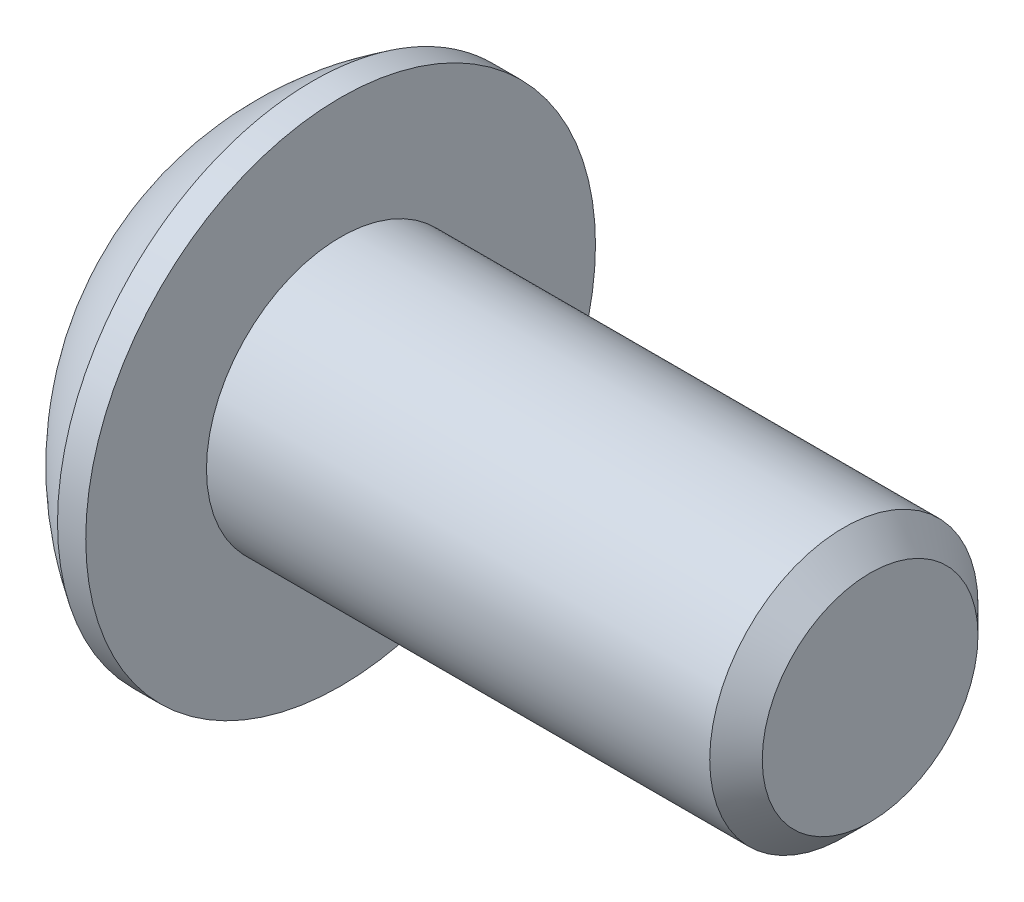
ISO-10303-21;
HEADER;
FILE_DESCRIPTION(('STEP AP214'),'2;1');
FILE_NAME('part.step','',(''),(''),'','','');
FILE_SCHEMA(('AUTOMOTIVE_DESIGN { 1 0 10303 214 1 1 1 1 }'));
ENDSEC;
DATA;
#1=APPLICATION_CONTEXT('core data for automotive mechanical design processes');
#2=APPLICATION_PROTOCOL_DEFINITION('international standard','automotive_design',2000,#1);
#3=PRODUCT_CONTEXT('',#1,'mechanical');
#4=PRODUCT('Part','Part','',(#3));
#5=PRODUCT_RELATED_PRODUCT_CATEGORY('part','',(#4));
#6=PRODUCT_DEFINITION_FORMATION('','',#4);
#7=PRODUCT_DEFINITION_CONTEXT('part definition',#1,'design');
#8=PRODUCT_DEFINITION('design','',#6,#7);
#9=PRODUCT_DEFINITION_SHAPE('','',#8);
#10=(LENGTH_UNIT() NAMED_UNIT(*) SI_UNIT(.MILLI.,.METRE.));
#11=(NAMED_UNIT(*) PLANE_ANGLE_UNIT() SI_UNIT($,.RADIAN.));
#12=(NAMED_UNIT(*) SI_UNIT($,.STERADIAN.) SOLID_ANGLE_UNIT());
#13=UNCERTAINTY_MEASURE_WITH_UNIT(LENGTH_MEASURE(1.E-05),#10,'distance_accuracy_value','');
#14=(GEOMETRIC_REPRESENTATION_CONTEXT(3) GLOBAL_UNCERTAINTY_ASSIGNED_CONTEXT((#13)) GLOBAL_UNIT_ASSIGNED_CONTEXT((#10,
#11,#12)) REPRESENTATION_CONTEXT('',''));
#15=CARTESIAN_POINT('',(0.,0.,0.));
#16=DIRECTION('',(0.,0.,1.));
#17=DIRECTION('',(1.,0.,0.));
#18=AXIS2_PLACEMENT_3D('',#15,#16,#17);
#19=CARTESIAN_POINT('',(1.77800000000006,0.,0.));
#20=DIRECTION('',(-1.,0.,0.));
#21=DIRECTION('',(0.,0.,1.));
#22=AXIS2_PLACEMENT_3D('',#19,#20,#21);
#23=CONICAL_SURFACE('',#22,1.58750000000007,1.04719755119647);
#24=CARTESIAN_POINT('',(2.69454355233878,0.,0.));
#25=VERTEX_POINT('',#24);
#26=VERTEX_LOOP('',#25);
#27=FACE_BOUND('',#26,.T.);
#28=CARTESIAN_POINT('',(1.77800000000006,0.,0.));
#29=DIRECTION('',(-1.,0.,0.));
#30=DIRECTION('',(0.,0.,1.));
#31=AXIS2_PLACEMENT_3D('',#28,#29,#30);
#32=CIRCLE('',#31,1.58750000000007);
#33=CARTESIAN_POINT('',(1.77800000000003,0.,1.58750000000004));
#34=VERTEX_POINT('',#33);
#35=CARTESIAN_POINT('',(1.77800000000003,-1.37481532850783,0.793750000000017));
#36=VERTEX_POINT('',#35);
#37=EDGE_CURVE('E20',#34,#36,#32,.F.);
#38=ORIENTED_EDGE('',*,*,#37,.F.);
#39=CARTESIAN_POINT('',(1.77800000000006,0.,0.));
#40=DIRECTION('',(-1.,0.,0.));
#41=DIRECTION('',(0.,0.,1.));
#42=AXIS2_PLACEMENT_3D('',#39,#40,#41);
#43=CIRCLE('',#42,1.58750000000007);
#44=CARTESIAN_POINT('',(1.77800000000003,1.37481532850783,0.793750000000019));
#45=VERTEX_POINT('',#44);
#46=EDGE_CURVE('E90',#34,#45,#43,.T.);
#47=ORIENTED_EDGE('',*,*,#46,.T.);
#48=CARTESIAN_POINT('',(1.77800000000006,0.,0.));
#49=DIRECTION('',(-1.,0.,0.));
#50=DIRECTION('',(0.,0.,1.));
#51=AXIS2_PLACEMENT_3D('',#48,#49,#50);
#52=CIRCLE('',#51,1.58750000000007);
#53=CARTESIAN_POINT('',(1.77800000000003,1.37481532850783,-0.793750000000019));
#54=VERTEX_POINT('',#53);
#55=EDGE_CURVE('E106',#45,#54,#52,.T.);
#56=ORIENTED_EDGE('',*,*,#55,.T.);
#57=CARTESIAN_POINT('',(1.77800000000006,0.,0.));
#58=DIRECTION('',(-1.,0.,0.));
#59=DIRECTION('',(0.,0.,1.));
#60=AXIS2_PLACEMENT_3D('',#57,#58,#59);
#61=CIRCLE('',#60,1.58750000000007);
#62=CARTESIAN_POINT('',(1.77800000000003,-2.78602967841758E-12,-1.58750000000004));
#63=VERTEX_POINT('',#62);
#64=EDGE_CURVE('E444',#54,#63,#61,.T.);
#65=ORIENTED_EDGE('',*,*,#64,.T.);
#66=CARTESIAN_POINT('',(1.77800000000006,0.,0.));
#67=DIRECTION('',(-1.,0.,0.));
#68=DIRECTION('',(0.,0.,1.));
#69=AXIS2_PLACEMENT_3D('',#66,#67,#68);
#70=CIRCLE('',#69,1.58750000000007);
#71=CARTESIAN_POINT('',(1.77800000000003,-1.37481532850783,-0.793750000000017));
#72=VERTEX_POINT('',#71);
#73=EDGE_CURVE('E446',#72,#63,#70,.F.);
#74=ORIENTED_EDGE('',*,*,#73,.F.);
#75=CARTESIAN_POINT('',(1.77800000000006,0.,0.));
#76=DIRECTION('',(-1.,0.,0.));
#77=DIRECTION('',(0.,0.,1.));
#78=AXIS2_PLACEMENT_3D('',#75,#76,#77);
#79=CIRCLE('',#78,1.58750000000007);
#80=EDGE_CURVE('E93',#36,#72,#79,.F.);
#81=ORIENTED_EDGE('',*,*,#80,.F.);
#82=EDGE_LOOP('',(#38,#47,#56,#65,#74,#81));
#83=FACE_BOUND('',#82,.T.);
#84=ADVANCED_FACE('F17',(#27,#83),#23,.F.);
#85=CARTESIAN_POINT('',(1.778,-2.74963065701559,-1.5875));
#86=DIRECTION('',(1.,0.,0.));
#87=DIRECTION('',(0.,0.,-1.));
#88=AXIS2_PLACEMENT_3D('',#85,#86,#87);
#89=PLANE('',#88);
#90=DIRECTION('',(0.,0.5,0.866025403784439));
#91=VECTOR('',#90,1.);
#92=CARTESIAN_POINT('',(1.778,-1.83308710467706,0.));
#93=LINE('',#92,#91);
#94=CARTESIAN_POINT('',(1.778,-0.91654355233853,1.5875));
#95=VERTEX_POINT('',#94);
#96=EDGE_CURVE('E111',#95,#36,#93,.F.);
#97=ORIENTED_EDGE('',*,*,#96,.F.);
#98=DIRECTION('',(0.,1.,0.));
#99=VECTOR('',#98,1.);
#100=CARTESIAN_POINT('',(1.778,-0.91654355233853,1.5875));
#101=LINE('',#100,#99);
#102=EDGE_CURVE('E109',#34,#95,#101,.F.);
#103=ORIENTED_EDGE('',*,*,#102,.F.);
#104=ORIENTED_EDGE('',*,*,#37,.T.);
#105=EDGE_LOOP('',(#97,#103,#104));
#106=FACE_BOUND('',#105,.T.);
#107=ADVANCED_FACE('F110',(#106),#89,.F.);
#108=CARTESIAN_POINT('',(1.778,-2.74963065701559,-1.5875));
#109=DIRECTION('',(1.,0.,0.));
#110=DIRECTION('',(0.,0.,-1.));
#111=AXIS2_PLACEMENT_3D('',#108,#109,#110);
#112=PLANE('',#111);
#113=DIRECTION('',(0.,-0.5,0.866025403784439));
#114=VECTOR('',#113,1.);
#115=CARTESIAN_POINT('',(1.778,-0.91654355233853,-1.5875));
#116=LINE('',#115,#114);
#117=CARTESIAN_POINT('',(1.778,-1.83308710467706,0.));
#118=VERTEX_POINT('',#117);
#119=EDGE_CURVE('E159',#118,#72,#116,.F.);
#120=ORIENTED_EDGE('',*,*,#119,.F.);
#121=DIRECTION('',(0.,0.5,0.866025403784439));
#122=VECTOR('',#121,1.);
#123=CARTESIAN_POINT('',(1.778,-1.83308710467706,0.));
#124=LINE('',#123,#122);
#125=EDGE_CURVE('E171',#36,#118,#124,.F.);
#126=ORIENTED_EDGE('',*,*,#125,.F.);
#127=ORIENTED_EDGE('',*,*,#80,.T.);
#128=EDGE_LOOP('',(#120,#126,#127));
#129=FACE_BOUND('',#128,.T.);
#130=ADVANCED_FACE('F248',(#129),#112,.F.);
#131=CARTESIAN_POINT('',(1.778,-2.74963065701559,-1.5875));
#132=DIRECTION('',(1.,0.,0.));
#133=DIRECTION('',(0.,0.,-1.));
#134=AXIS2_PLACEMENT_3D('',#131,#132,#133);
#135=PLANE('',#134);
#136=DIRECTION('',(0.,1.,0.));
#137=VECTOR('',#136,1.);
#138=CARTESIAN_POINT('',(1.778,0.916543552338532,-1.5875));
#139=LINE('',#138,#137);
#140=CARTESIAN_POINT('',(1.778,-0.91654355233853,-1.5875));
#141=VERTEX_POINT('',#140);
#142=EDGE_CURVE('E143',#141,#63,#139,.T.);
#143=ORIENTED_EDGE('',*,*,#142,.F.);
#144=DIRECTION('',(0.,-0.5,0.866025403784439));
#145=VECTOR('',#144,1.);
#146=CARTESIAN_POINT('',(1.778,-0.91654355233853,-1.5875));
#147=LINE('',#146,#145);
#148=EDGE_CURVE('E156',#72,#141,#147,.F.);
#149=ORIENTED_EDGE('',*,*,#148,.F.);
#150=ORIENTED_EDGE('',*,*,#73,.T.);
#151=EDGE_LOOP('',(#143,#149,#150));
#152=FACE_BOUND('',#151,.T.);
#153=ADVANCED_FACE('F244',(#152),#135,.F.);
#154=CARTESIAN_POINT('',(1.778,-2.74963065701559,-1.5875));
#155=DIRECTION('',(1.,0.,0.));
#156=DIRECTION('',(0.,0.,-1.));
#157=AXIS2_PLACEMENT_3D('',#154,#155,#156);
#158=PLANE('',#157);
#159=DIRECTION('',(0.,-0.5,-0.866025403784439));
#160=VECTOR('',#159,1.);
#161=CARTESIAN_POINT('',(1.778,1.83308710467706,0.));
#162=LINE('',#161,#160);
#163=CARTESIAN_POINT('',(1.778,0.916543552338532,-1.5875));
#164=VERTEX_POINT('',#163);
#165=EDGE_CURVE('E128',#164,#54,#162,.F.);
#166=ORIENTED_EDGE('',*,*,#165,.F.);
#167=DIRECTION('',(0.,1.,0.));
#168=VECTOR('',#167,1.);
#169=CARTESIAN_POINT('',(1.778,0.916543552338532,-1.5875));
#170=LINE('',#169,#168);
#171=EDGE_CURVE('E140',#63,#164,#170,.T.);
#172=ORIENTED_EDGE('',*,*,#171,.F.);
#173=ORIENTED_EDGE('',*,*,#64,.F.);
#174=EDGE_LOOP('',(#166,#172,#173));
#175=FACE_BOUND('',#174,.T.);
#176=ADVANCED_FACE('F240',(#175),#158,.F.);
#177=CARTESIAN_POINT('',(1.778,-2.74963065701559,-1.5875));
#178=DIRECTION('',(1.,0.,0.));
#179=DIRECTION('',(0.,0.,-1.));
#180=AXIS2_PLACEMENT_3D('',#177,#178,#179);
#181=PLANE('',#180);
#182=DIRECTION('',(0.,0.5,-0.866025403784439));
#183=VECTOR('',#182,1.);
#184=CARTESIAN_POINT('',(1.778,0.916543552338533,1.5875));
#185=LINE('',#184,#183);
#186=CARTESIAN_POINT('',(1.778,1.83308710467706,0.));
#187=VERTEX_POINT('',#186);
#188=EDGE_CURVE('E148',#187,#45,#185,.F.);
#189=ORIENTED_EDGE('',*,*,#188,.F.);
#190=DIRECTION('',(0.,-0.5,-0.866025403784439));
#191=VECTOR('',#190,1.);
#192=CARTESIAN_POINT('',(1.778,1.83308710467706,0.));
#193=LINE('',#192,#191);
#194=EDGE_CURVE('E125',#54,#187,#193,.F.);
#195=ORIENTED_EDGE('',*,*,#194,.F.);
#196=ORIENTED_EDGE('',*,*,#55,.F.);
#197=EDGE_LOOP('',(#189,#195,#196));
#198=FACE_BOUND('',#197,.T.);
#199=ADVANCED_FACE('F237',(#198),#181,.F.);
#200=CARTESIAN_POINT('',(1.778,-2.74963065701559,-1.5875));
#201=DIRECTION('',(1.,0.,0.));
#202=DIRECTION('',(0.,0.,-1.));
#203=AXIS2_PLACEMENT_3D('',#200,#201,#202);
#204=PLANE('',#203);
#205=DIRECTION('',(0.,1.,0.));
#206=VECTOR('',#205,1.);
#207=CARTESIAN_POINT('',(1.778,-0.91654355233853,1.5875));
#208=LINE('',#207,#206);
#209=CARTESIAN_POINT('',(1.778,0.916543552338533,1.5875));
#210=VERTEX_POINT('',#209);
#211=EDGE_CURVE('E101',#210,#34,#208,.F.);
#212=ORIENTED_EDGE('',*,*,#211,.F.);
#213=DIRECTION('',(0.,0.5,-0.866025403784439));
#214=VECTOR('',#213,1.);
#215=CARTESIAN_POINT('',(1.778,0.916543552338533,1.5875));
#216=LINE('',#215,#214);
#217=EDGE_CURVE('E104',#45,#210,#216,.F.);
#218=ORIENTED_EDGE('',*,*,#217,.F.);
#219=ORIENTED_EDGE('',*,*,#46,.F.);
#220=EDGE_LOOP('',(#212,#218,#219));
#221=FACE_BOUND('',#220,.T.);
#222=ADVANCED_FACE('F99',(#221),#204,.F.);
#223=CARTESIAN_POINT('',(1.778,-0.91654355233853,1.5875));
#224=DIRECTION('',(0.,0.,-1.));
#225=DIRECTION('',(0.,1.,0.));
#226=AXIS2_PLACEMENT_3D('',#223,#224,#225);
#227=PLANE('',#226);
#228=DIRECTION('',(0.,1.,0.));
#229=VECTOR('',#228,1.);
#230=CARTESIAN_POINT('',(0.,0.,1.5875));
#231=LINE('',#230,#229);
#232=CARTESIAN_POINT('',(0.,0.916543552338532,1.5875));
#233=VERTEX_POINT('',#232);
#234=CARTESIAN_POINT('',(0.,-0.91654355233853,1.5875));
#235=VERTEX_POINT('',#234);
#236=EDGE_CURVE('E132',#233,#235,#231,.F.);
#237=ORIENTED_EDGE('',*,*,#236,.F.);
#238=DIRECTION('',(1.,0.,0.));
#239=VECTOR('',#238,1.);
#240=CARTESIAN_POINT('',(1.778,0.916543552338533,1.5875));
#241=LINE('',#240,#239);
#242=EDGE_CURVE('E117',#210,#233,#241,.F.);
#243=ORIENTED_EDGE('',*,*,#242,.F.);
#244=ORIENTED_EDGE('',*,*,#211,.T.);
#245=ORIENTED_EDGE('',*,*,#102,.T.);
#246=DIRECTION('',(1.,0.,0.));
#247=VECTOR('',#246,1.);
#248=CARTESIAN_POINT('',(1.778,-0.91654355233853,1.5875));
#249=LINE('',#248,#247);
#250=EDGE_CURVE('E168',#235,#95,#249,.T.);
#251=ORIENTED_EDGE('',*,*,#250,.F.);
#252=EDGE_LOOP('',(#237,#243,#244,#245,#251));
#253=FACE_BOUND('',#252,.T.);
#254=ADVANCED_FACE('F115',(#253),#227,.T.);
#255=CARTESIAN_POINT('',(1.778,-1.83308710467706,0.));
#256=DIRECTION('',(0.,0.866025403784439,-0.5));
#257=DIRECTION('',(0.,0.5,0.866025403784439));
#258=AXIS2_PLACEMENT_3D('',#255,#256,#257);
#259=PLANE('',#258);
#260=DIRECTION('',(0.,-0.5,-0.866025403784439));
#261=VECTOR('',#260,1.);
#262=CARTESIAN_POINT('',(0.,-0.91654355233853,1.5875));
#263=LINE('',#262,#261);
#264=CARTESIAN_POINT('',(0.,-1.83308710467706,0.));
#265=VERTEX_POINT('',#264);
#266=EDGE_CURVE('E430',#235,#265,#263,.T.);
#267=ORIENTED_EDGE('',*,*,#266,.F.);
#268=ORIENTED_EDGE('',*,*,#250,.T.);
#269=ORIENTED_EDGE('',*,*,#96,.T.);
#270=ORIENTED_EDGE('',*,*,#125,.T.);
#271=DIRECTION('',(1.,0.,0.));
#272=VECTOR('',#271,1.);
#273=CARTESIAN_POINT('',(1.778,-1.83308710467706,0.));
#274=LINE('',#273,#272);
#275=EDGE_CURVE('E153',#265,#118,#274,.T.);
#276=ORIENTED_EDGE('',*,*,#275,.F.);
#277=EDGE_LOOP('',(#267,#268,#269,#270,#276));
#278=FACE_BOUND('',#277,.T.);
#279=ADVANCED_FACE('F228',(#278),#259,.T.);
#280=CARTESIAN_POINT('',(1.778,-0.91654355233853,-1.5875));
#281=DIRECTION('',(0.,0.866025403784439,0.5));
#282=DIRECTION('',(0.,-0.5,0.866025403784439));
#283=AXIS2_PLACEMENT_3D('',#280,#281,#282);
#284=PLANE('',#283);
#285=DIRECTION('',(0.,0.5,-0.866025403784439));
#286=VECTOR('',#285,1.);
#287=CARTESIAN_POINT('',(0.,-1.83308710467706,0.));
#288=LINE('',#287,#286);
#289=CARTESIAN_POINT('',(0.,-0.91654355233853,-1.5875));
#290=VERTEX_POINT('',#289);
#291=EDGE_CURVE('E427',#265,#290,#288,.T.);
#292=ORIENTED_EDGE('',*,*,#291,.F.);
#293=ORIENTED_EDGE('',*,*,#275,.T.);
#294=ORIENTED_EDGE('',*,*,#119,.T.);
#295=ORIENTED_EDGE('',*,*,#148,.T.);
#296=DIRECTION('',(1.,0.,0.));
#297=VECTOR('',#296,1.);
#298=CARTESIAN_POINT('',(1.778,-0.91654355233853,-1.5875));
#299=LINE('',#298,#297);
#300=EDGE_CURVE('E137',#290,#141,#299,.T.);
#301=ORIENTED_EDGE('',*,*,#300,.F.);
#302=EDGE_LOOP('',(#292,#293,#294,#295,#301));
#303=FACE_BOUND('',#302,.T.);
#304=ADVANCED_FACE('F224',(#303),#284,.T.);
#305=CARTESIAN_POINT('',(1.778,0.916543552338532,-1.5875));
#306=DIRECTION('',(0.,0.,1.));
#307=DIRECTION('',(1.,0.,0.));
#308=AXIS2_PLACEMENT_3D('',#305,#306,#307);
#309=PLANE('',#308);
#310=DIRECTION('',(0.,1.,0.));
#311=VECTOR('',#310,1.);
#312=CARTESIAN_POINT('',(0.,0.,-1.5875));
#313=LINE('',#312,#311);
#314=CARTESIAN_POINT('',(0.,0.916543552338532,-1.5875));
#315=VERTEX_POINT('',#314);
#316=EDGE_CURVE('E424',#290,#315,#313,.T.);
#317=ORIENTED_EDGE('',*,*,#316,.F.);
#318=ORIENTED_EDGE('',*,*,#300,.T.);
#319=ORIENTED_EDGE('',*,*,#142,.T.);
#320=ORIENTED_EDGE('',*,*,#171,.T.);
#321=DIRECTION('',(1.,0.,0.));
#322=VECTOR('',#321,1.);
#323=CARTESIAN_POINT('',(1.778,0.916543552338532,-1.5875));
#324=LINE('',#323,#322);
#325=EDGE_CURVE('E127',#315,#164,#324,.T.);
#326=ORIENTED_EDGE('',*,*,#325,.F.);
#327=EDGE_LOOP('',(#317,#318,#319,#320,#326));
#328=FACE_BOUND('',#327,.T.);
#329=ADVANCED_FACE('F221',(#328),#309,.T.);
#330=CARTESIAN_POINT('',(1.778,1.83308710467706,0.));
#331=DIRECTION('',(0.,-0.866025403784439,0.5));
#332=DIRECTION('',(0.,-0.5,-0.866025403784439));
#333=AXIS2_PLACEMENT_3D('',#330,#331,#332);
#334=PLANE('',#333);
#335=DIRECTION('',(0.,0.5,0.866025403784438));
#336=VECTOR('',#335,1.);
#337=CARTESIAN_POINT('',(0.,0.916543552338532,-1.5875));
#338=LINE('',#337,#336);
#339=CARTESIAN_POINT('',(0.,1.83308710467706,0.));
#340=VERTEX_POINT('',#339);
#341=EDGE_CURVE('E421',#315,#340,#338,.T.);
#342=ORIENTED_EDGE('',*,*,#341,.F.);
#343=ORIENTED_EDGE('',*,*,#325,.T.);
#344=ORIENTED_EDGE('',*,*,#165,.T.);
#345=ORIENTED_EDGE('',*,*,#194,.T.);
#346=DIRECTION('',(1.,0.,0.));
#347=VECTOR('',#346,1.);
#348=CARTESIAN_POINT('',(1.778,1.83308710467706,0.));
#349=LINE('',#348,#347);
#350=EDGE_CURVE('E35',#340,#187,#349,.T.);
#351=ORIENTED_EDGE('',*,*,#350,.F.);
#352=EDGE_LOOP('',(#342,#343,#344,#345,#351));
#353=FACE_BOUND('',#352,.T.);
#354=ADVANCED_FACE('F217',(#353),#334,.T.);
#355=CARTESIAN_POINT('',(1.778,0.916543552338533,1.5875));
#356=DIRECTION('',(0.,-0.866025403784439,-0.5));
#357=DIRECTION('',(0.,0.5,-0.866025403784439));
#358=AXIS2_PLACEMENT_3D('',#355,#356,#357);
#359=PLANE('',#358);
#360=DIRECTION('',(0.,-0.5,0.866025403784439));
#361=VECTOR('',#360,1.);
#362=CARTESIAN_POINT('',(0.,1.83308710467706,0.));
#363=LINE('',#362,#361);
#364=EDGE_CURVE('E203',#340,#233,#363,.T.);
#365=ORIENTED_EDGE('',*,*,#364,.F.);
#366=ORIENTED_EDGE('',*,*,#350,.T.);
#367=ORIENTED_EDGE('',*,*,#188,.T.);
#368=ORIENTED_EDGE('',*,*,#217,.T.);
#369=ORIENTED_EDGE('',*,*,#242,.T.);
#370=EDGE_LOOP('',(#365,#366,#367,#368,#369));
#371=FACE_BOUND('',#370,.T.);
#372=ADVANCED_FACE('F213',(#371),#359,.T.);
#373=CARTESIAN_POINT('',(0.,0.,0.));
#374=DIRECTION('',(-1.,0.,0.));
#375=DIRECTION('',(0.,0.,1.));
#376=AXIS2_PLACEMENT_3D('',#373,#374,#375);
#377=PLANE('',#376);
#378=ORIENTED_EDGE('',*,*,#341,.T.);
#379=ORIENTED_EDGE('',*,*,#364,.T.);
#380=ORIENTED_EDGE('',*,*,#236,.T.);
#381=ORIENTED_EDGE('',*,*,#266,.T.);
#382=ORIENTED_EDGE('',*,*,#291,.T.);
#383=ORIENTED_EDGE('',*,*,#316,.T.);
#384=EDGE_LOOP('',(#378,#379,#380,#381,#382,#383));
#385=FACE_BOUND('',#384,.T.);
#386=CARTESIAN_POINT('',(0.,2.29235,0.));
#387=CARTESIAN_POINT('',(0.,2.29234961429956,0.0643619991867155));
#388=CARTESIAN_POINT('',(0.,2.28963695190107,0.128735826629365));
#389=CARTESIAN_POINT('',(0.,2.27880393843647,0.257038618985286));
#390=CARTESIAN_POINT('',(0.,2.27068199085126,0.320967446929162));
#391=CARTESIAN_POINT('',(0.,2.24906694794255,0.448021254607717));
#392=CARTESIAN_POINT('',(-2.10840056970795E-13,2.2355653265346,0.51114479338186));
#393=CARTESIAN_POINT('',(2.11879226109671E-13,2.20328400495644,0.636065176149321));
#394=CARTESIAN_POINT('',(7.89917625163527E-13,2.18450002159113,0.697860899533934));
#395=CARTESIAN_POINT('',(1.31285126424162E-12,2.12048422735802,0.880329802927747));
#396=CARTESIAN_POINT('',(0.,2.06753599079459,0.998391795928116));
#397=CARTESIAN_POINT('',(0.,1.94254204858672,1.22393765942147));
#398=CARTESIAN_POINT('',(1.0943500696831E-12,1.87049561696642,1.33142112758208));
#399=CARTESIAN_POINT('',(6.78225420709987E-13,1.7497425419488,1.48237719670935));
#400=CARTESIAN_POINT('',(1.81996039545648E-13,1.707345731323,1.53101280076737));
#401=CARTESIAN_POINT('',(-1.80953624347813E-13,1.61863910291529,1.62450601319185));
#402=CARTESIAN_POINT('',(0.,1.57233309727312,1.66936721890417));
#403=CARTESIAN_POINT('',(0.,1.47608431707233,1.7550488420402));
#404=CARTESIAN_POINT('',(0.,1.42613990458994,1.79586741981512));
#405=CARTESIAN_POINT('',(0.,1.3229945254125,1.87315615311522));
#406=CARTESIAN_POINT('',(0.,1.26979280714187,1.90962529930697));
#407=CARTESIAN_POINT('',(0.,1.10588180153952,2.01207722151089));
#408=CARTESIAN_POINT('',(0.,0.990764947001307,2.07119486286666));
#409=CARTESIAN_POINT('',(0.,0.752302198839713,2.16922858468856));
#410=CARTESIAN_POINT('',(0.,0.628956393121256,2.20814488091449));
#411=CARTESIAN_POINT('',(0.,0.377466101733266,2.2647275576592));
#412=CARTESIAN_POINT('',(0.,0.249321590440377,2.28239382469379));
#413=CARTESIAN_POINT('',(0.,-0.00811435371610997,2.29595665980955));
#414=CARTESIAN_POINT('',(0.,-0.137405786579708,2.29185322789072));
#415=CARTESIAN_POINT('',(0.,-0.393449386933728,2.2620096240906));
#416=CARTESIAN_POINT('',(0.,-0.520201567981086,2.23626956775766));
#417=CARTESIAN_POINT('',(0.,-0.767645294384453,2.16383549332687));
#418=CARTESIAN_POINT('',(0.,-0.888336774993558,2.11714125142685));
#419=CARTESIAN_POINT('',(0.,-1.06210572146656,2.03247976453654));
#420=CARTESIAN_POINT('',(0.,-1.11884498714067,2.00180278323695));
#421=CARTESIAN_POINT('',(0.,-1.22954062855573,1.93578011658036));
#422=CARTESIAN_POINT('',(0.,-1.28349764565393,1.9004355139425));
#423=CARTESIAN_POINT('',(0.,-1.38821676641538,1.82534174602347));
#424=CARTESIAN_POINT('',(0.,-1.43898030563029,1.78559458231503));
#425=CARTESIAN_POINT('',(0.,-1.53701984534432,1.70193996292361));
#426=CARTESIAN_POINT('',(0.,-1.58429243280551,1.65802852924127));
#427=CARTESIAN_POINT('',(0.,-1.72023903553759,1.52059650554139));
#428=CARTESIAN_POINT('',(0.,-1.80318066138239,1.42127847626519));
#429=CARTESIAN_POINT('',(0.,-1.95118232345099,1.21011519784664));
#430=CARTESIAN_POINT('',(0.,-2.01624303935585,1.09827042509272));
#431=CARTESIAN_POINT('',(0.,-2.09907772661315,0.923538238005837));
#432=CARTESIAN_POINT('',(0.,-2.12425103063559,0.864058373981965));
#433=CARTESIAN_POINT('',(0.,-2.16947990046566,0.7432215621756));
#434=CARTESIAN_POINT('',(0.,-2.18953960800685,0.681866178863365));
#435=CARTESIAN_POINT('',(0.,-2.22438542051157,0.557786972400357));
#436=CARTESIAN_POINT('',(0.,-2.23917985294819,0.495065478128173));
#437=CARTESIAN_POINT('',(0.,-2.26343456384454,0.368611258323516));
#438=CARTESIAN_POINT('',(0.,-2.27289641559286,0.30487883675957));
#439=CARTESIAN_POINT('',(0.,-2.28388649696737,0.200873029360625));
#440=CARTESIAN_POINT('',(0.,-2.28705930623294,0.160766164180098));
#441=CARTESIAN_POINT('',(0.,-2.29129117827045,0.0804410725432715));
#442=CARTESIAN_POINT('',(0.,-2.29235024104239,0.0402228460869717));
#443=CARTESIAN_POINT('',(0.,-2.29234961429957,-0.0643619991867168));
#444=CARTESIAN_POINT('',(0.,-2.28963695190109,-0.128735826629366));
#445=CARTESIAN_POINT('',(0.,-2.27880393843648,-0.257038618985287));
#446=CARTESIAN_POINT('',(0.,-2.27068199085127,-0.320967446929163));
#447=CARTESIAN_POINT('',(0.,-2.24906694794256,-0.448021254607718));
#448=CARTESIAN_POINT('',(-2.11158505516439E-13,-2.23556532653461,-0.511144793381861));
#449=CARTESIAN_POINT('',(2.12197933617066E-13,-2.20328400495644,-0.636065176149321));
#450=CARTESIAN_POINT('',(7.91271169771705E-13,-2.18450002159114,-0.697860899533935));
#451=CARTESIAN_POINT('',(1.31534652841856E-12,-2.12048422735803,-0.880329802927748));
#452=CARTESIAN_POINT('',(0.,-2.06753599079459,-0.998391795928114));
#453=CARTESIAN_POINT('',(0.,-1.94254204858673,-1.22393765942147));
#454=CARTESIAN_POINT('',(1.09423089153949E-12,-1.87049561696643,-1.33142112758208));
#455=CARTESIAN_POINT('',(6.78285087865736E-13,-1.74974254194881,-1.48237719670935));
#456=CARTESIAN_POINT('',(1.82011279261461E-13,-1.70734573132301,-1.53101280076737));
#457=CARTESIAN_POINT('',(-1.80968849370244E-13,-1.61863910291529,-1.62450601319185));
#458=CARTESIAN_POINT('',(0.,-1.57233309727313,-1.66936721890417));
#459=CARTESIAN_POINT('',(0.,-1.47608431707234,-1.7550488420402));
#460=CARTESIAN_POINT('',(0.,-1.42613990458995,-1.79586741981512));
#461=CARTESIAN_POINT('',(0.,-1.32299452541251,-1.87315615311522));
#462=CARTESIAN_POINT('',(0.,-1.26979280714188,-1.90962529930696));
#463=CARTESIAN_POINT('',(0.,-1.10588180153952,-2.01207722151089));
#464=CARTESIAN_POINT('',(0.,-0.990764947001314,-2.07119486286666));
#465=CARTESIAN_POINT('',(0.,-0.752302198839721,-2.16922858468856));
#466=CARTESIAN_POINT('',(0.,-0.628956393121265,-2.2081448809145));
#467=CARTESIAN_POINT('',(0.,-0.377466101733274,-2.2647275576592));
#468=CARTESIAN_POINT('',(0.,-0.249321590440385,-2.28239382469379));
#469=CARTESIAN_POINT('',(0.,0.0081143537161019,-2.29595665980955));
#470=CARTESIAN_POINT('',(0.,0.1374057865797,-2.29185322789072));
#471=CARTESIAN_POINT('',(0.,0.39344938693372,-2.2620096240906));
#472=CARTESIAN_POINT('',(0.,0.520201567981077,-2.23626956775766));
#473=CARTESIAN_POINT('',(0.,0.767645294384445,-2.16383549332687));
#474=CARTESIAN_POINT('',(0.,0.88833677499355,-2.11714125142685));
#475=CARTESIAN_POINT('',(0.,1.06210572146656,-2.03247976453654));
#476=CARTESIAN_POINT('',(0.,1.11884498714066,-2.00180278323695));
#477=CARTESIAN_POINT('',(0.,1.22954062855572,-1.93578011658036));
#478=CARTESIAN_POINT('',(0.,1.28349764565392,-1.9004355139425));
#479=CARTESIAN_POINT('',(0.,1.38821676641537,-1.82534174602348));
#480=CARTESIAN_POINT('',(0.,1.43898030563028,-1.78559458231503));
#481=CARTESIAN_POINT('',(0.,1.53701984534431,-1.70193996292361));
#482=CARTESIAN_POINT('',(0.,1.5842924328055,-1.65802852924127));
#483=CARTESIAN_POINT('',(0.,1.72023903553758,-1.52059650554139));
#484=CARTESIAN_POINT('',(0.,1.80318066138238,-1.42127847626519));
#485=CARTESIAN_POINT('',(0.,1.95118232345098,-1.21011519784664));
#486=CARTESIAN_POINT('',(0.,2.01624303935584,-1.09827042509272));
#487=CARTESIAN_POINT('',(0.,2.09907772661315,-0.923538238005838));
#488=CARTESIAN_POINT('',(0.,2.12425103063558,-0.864058373981966));
#489=CARTESIAN_POINT('',(0.,2.16947990046565,-0.7432215621756));
#490=CARTESIAN_POINT('',(0.,2.18953960800684,-0.681866178863365));
#491=CARTESIAN_POINT('',(0.,2.22438542051156,-0.557786972400357));
#492=CARTESIAN_POINT('',(0.,2.23917985294818,-0.495065478128172));
#493=CARTESIAN_POINT('',(0.,2.26343456384453,-0.368611258323515));
#494=CARTESIAN_POINT('',(0.,2.27289641559286,-0.304878836759569));
#495=CARTESIAN_POINT('',(0.,2.28388649696736,-0.200873029360625));
#496=CARTESIAN_POINT('',(0.,2.28705930623293,-0.160766164180098));
#497=CARTESIAN_POINT('',(0.,2.29129117827044,-0.0804410725432719));
#498=CARTESIAN_POINT('',(0.,2.29235024104238,-0.0402228460869725));
#499=CARTESIAN_POINT('',(0.,2.29235,0.));
#500=B_SPLINE_CURVE_WITH_KNOTS('',3,(#386,#387,#388,#389,#390,#391,#392,#393,#394,#395,#396,
#397,#398,#399,#400,#401,#402,#403,#404,#405,#406,#407,#408,#409,#410,#411,#412,#413,#414,#415,
#416,#417,#418,#419,#420,#421,#422,#423,#424,#425,#426,#427,#428,#429,#430,#431,#432,#433,#434,
#435,#436,#437,#438,#439,#440,#441,#442,#443,#444,#445,#446,#447,#448,#449,#450,#451,#452,#453,
#454,#455,#456,#457,#458,#459,#460,#461,#462,#463,#464,#465,#466,#467,#468,#469,#470,#471,#472,
#473,#474,#475,#476,#477,#478,#479,#480,#481,#482,#483,#484,#485,#486,#487,#488,#489,#490,#491,
#492,#493,#494,#495,#496,#497,#498,#499),.UNSPECIFIED.,.T.,.F.,(4,2,2,2,2,2,2,2,2,2,2,2,2,2,2,2,
2,2,2,2,2,2,2,2,2,2,2,2,2,2,2,2,2,2,2,2,2,2,2,2,2,2,2,2,2,2,2,2,2,2,2,2,2,2,2,2,4),(0.,
0.193048968618033,0.386154939782395,0.579568183995958,0.773138711491038,1.15935703864577,
1.54559004914645,1.73895960916368,1.93214273180063,2.12541336477221,2.31872876140888,
2.70495649282618,3.09118009906583,3.47740576789431,3.86363143672285,4.24985504296253,
4.63608277437979,4.82939817101619,5.02266880398748,5.2158519266242,5.40922148664122,
5.79545449714217,6.18167282429724,6.37524335179261,6.56865659600641,6.76176256717089,
6.95481153578908,7.07545693291922,7.19610233004937,7.3891512986674,7.58225726983176,
7.77567051404533,7.96924104154041,8.35545936869514,8.74169237919581,8.93506193921305,
9.12824506185,9.32151569482158,9.51483109145825,9.90105882287555,10.2872824291152,
10.6735080979437,11.0597337667722,11.4459573730119,11.8321851044292,12.0255005010656,
12.2187711340368,12.4119542566736,12.6053238166906,12.9915568271915,13.3777751543466,
13.571345681842,13.7647589260558,13.9578648972203,14.1509138658384,14.2715592629686,
14.3922046600987),.UNSPECIFIED.);
#501=CARTESIAN_POINT('',(0.,2.29235,0.));
#502=VERTEX_POINT('',#501);
#503=EDGE_CURVE('E197',#502,#502,#500,.T.);
#504=ORIENTED_EDGE('',*,*,#503,.F.);
#505=EDGE_LOOP('',(#504));
#506=FACE_BOUND('',#505,.T.);
#507=ADVANCED_FACE('F209',(#385,#506),#377,.T.);
#508=CARTESIAN_POINT('',(4.85989606481482,0.,0.));
#509=DIRECTION('',(0.,1.,0.));
#510=DIRECTION('',(1.,0.,0.));
#511=AXIS2_PLACEMENT_3D('',#508,#509,#510);
#512=SPHERICAL_SURFACE('',#511,5.37340285883187);
#513=CARTESIAN_POINT('',(2.0574,0.,0.));
#514=DIRECTION('',(-1.,0.,0.));
#515=DIRECTION('',(0.,0.,1.));
#516=AXIS2_PLACEMENT_3D('',#513,#514,#515);
#517=CIRCLE('',#516,4.5847);
#518=CARTESIAN_POINT('',(2.0574,0.,4.5847));
#519=VERTEX_POINT('',#518);
#520=EDGE_CURVE('E194',#519,#519,#517,.F.);
#521=ORIENTED_EDGE('',*,*,#520,.F.);
#522=EDGE_LOOP('',(#521));
#523=FACE_BOUND('',#522,.T.);
#524=ORIENTED_EDGE('',*,*,#503,.T.);
#525=EDGE_LOOP('',(#524));
#526=FACE_BOUND('',#525,.T.);
#527=ADVANCED_FACE('F205',(#523,#526),#512,.T.);
#528=CARTESIAN_POINT('',(12.0904,0.,0.));
#529=DIRECTION('',(-1.,0.,0.));
#530=DIRECTION('',(0.,0.,1.));
#531=AXIS2_PLACEMENT_3D('',#528,#529,#530);
#532=PLANE('',#531);
#533=CARTESIAN_POINT('',(12.09039999992,0.,0.));
#534=DIRECTION('',(-1.,0.,0.));
#535=DIRECTION('',(0.,0.,1.));
#536=AXIS2_PLACEMENT_3D('',#533,#534,#535);
#537=CIRCLE('',#536,1.94055999998);
#538=CARTESIAN_POINT('',(12.09039999992,0.,1.94055999998));
#539=VERTEX_POINT('',#538);
#540=EDGE_CURVE('E191',#539,#539,#537,.T.);
#541=ORIENTED_EDGE('',*,*,#540,.F.);
#542=EDGE_LOOP('',(#541));
#543=FACE_BOUND('',#542,.T.);
#544=ADVANCED_FACE('F276',(#543),#532,.F.);
#545=CARTESIAN_POINT('',(0.,0.,0.));
#546=DIRECTION('',(-1.,0.,0.));
#547=DIRECTION('',(0.,0.,1.));
#548=AXIS2_PLACEMENT_3D('',#545,#546,#547);
#549=CYLINDRICAL_SURFACE('',#548,4.5847);
#550=ORIENTED_EDGE('',*,*,#520,.T.);
#551=EDGE_LOOP('',(#550));
#552=FACE_BOUND('',#551,.T.);
#553=CARTESIAN_POINT('',(2.5654,0.,0.));
#554=DIRECTION('',(-1.,0.,0.));
#555=DIRECTION('',(0.,0.,1.));
#556=AXIS2_PLACEMENT_3D('',#553,#554,#555);
#557=CIRCLE('',#556,4.5847);
#558=CARTESIAN_POINT('',(2.5654,0.,4.5847));
#559=VERTEX_POINT('',#558);
#560=EDGE_CURVE('E188',#559,#559,#557,.T.);
#561=ORIENTED_EDGE('',*,*,#560,.T.);
#562=EDGE_LOOP('',(#561));
#563=FACE_BOUND('',#562,.T.);
#564=ADVANCED_FACE('F273',(#552,#563),#549,.T.);
#565=CARTESIAN_POINT('',(11.6179599999668,0.,0.));
#566=DIRECTION('',(-1.,0.,0.));
#567=DIRECTION('',(0.,0.,1.));
#568=AXIS2_PLACEMENT_3D('',#565,#566,#567);
#569=CONICAL_SURFACE('',#568,2.41299999993316,0.785398163397448);
#570=CARTESIAN_POINT('',(11.61796,0.,0.));
#571=DIRECTION('',(-1.,0.,0.));
#572=DIRECTION('',(0.,0.,1.));
#573=AXIS2_PLACEMENT_3D('',#570,#571,#572);
#574=CIRCLE('',#573,2.413);
#575=CARTESIAN_POINT('',(11.61796,0.,2.413));
#576=VERTEX_POINT('',#575);
#577=EDGE_CURVE('E26',#576,#576,#574,.T.);
#578=ORIENTED_EDGE('',*,*,#577,.F.);
#579=EDGE_LOOP('',(#578));
#580=FACE_BOUND('',#579,.T.);
#581=ORIENTED_EDGE('',*,*,#540,.T.);
#582=EDGE_LOOP('',(#581));
#583=FACE_BOUND('',#582,.T.);
#584=ADVANCED_FACE('F266',(#580,#583),#569,.T.);
#585=CARTESIAN_POINT('',(2.5654,2.41299999999999,0.));
#586=DIRECTION('',(-1.,0.,0.));
#587=DIRECTION('',(0.,0.,1.));
#588=AXIS2_PLACEMENT_3D('',#585,#586,#587);
#589=PLANE('',#588);
#590=CARTESIAN_POINT('',(2.5654,0.,0.));
#591=DIRECTION('',(-1.,0.,0.));
#592=DIRECTION('',(0.,0.,1.));
#593=AXIS2_PLACEMENT_3D('',#590,#591,#592);
#594=CIRCLE('',#593,2.413);
#595=CARTESIAN_POINT('',(2.5654,0.,2.413));
#596=VERTEX_POINT('',#595);
#597=EDGE_CURVE('E11',#596,#596,#594,.F.);
#598=ORIENTED_EDGE('',*,*,#597,.F.);
#599=EDGE_LOOP('',(#598));
#600=FACE_BOUND('',#599,.T.);
#601=ORIENTED_EDGE('',*,*,#560,.F.);
#602=EDGE_LOOP('',(#601));
#603=FACE_BOUND('',#602,.T.);
#604=ADVANCED_FACE('F260',(#600,#603),#589,.F.);
#605=CARTESIAN_POINT('',(0.,0.,0.));
#606=DIRECTION('',(-1.,0.,0.));
#607=DIRECTION('',(0.,0.,1.));
#608=AXIS2_PLACEMENT_3D('',#605,#606,#607);
#609=CYLINDRICAL_SURFACE('',#608,2.413);
#610=ORIENTED_EDGE('',*,*,#597,.T.);
#611=EDGE_LOOP('',(#610));
#612=FACE_BOUND('',#611,.T.);
#613=ORIENTED_EDGE('',*,*,#577,.T.);
#614=EDGE_LOOP('',(#613));
#615=FACE_BOUND('',#614,.T.);
#616=ADVANCED_FACE('F258',(#612,#615),#609,.T.);
#617=CLOSED_SHELL('',(#84,#107,#130,#153,#176,#199,#222,#254,#279,#304,#329,#354,#372,#507,#527,
#544,#564,#584,#604,#616));
#618=MANIFOLD_SOLID_BREP('B1',#617);
#619=ADVANCED_BREP_SHAPE_REPRESENTATION('',(#18,#618),#14);
#620=SHAPE_DEFINITION_REPRESENTATION(#9,#619);
ENDSEC;
END-ISO-10303-21;
